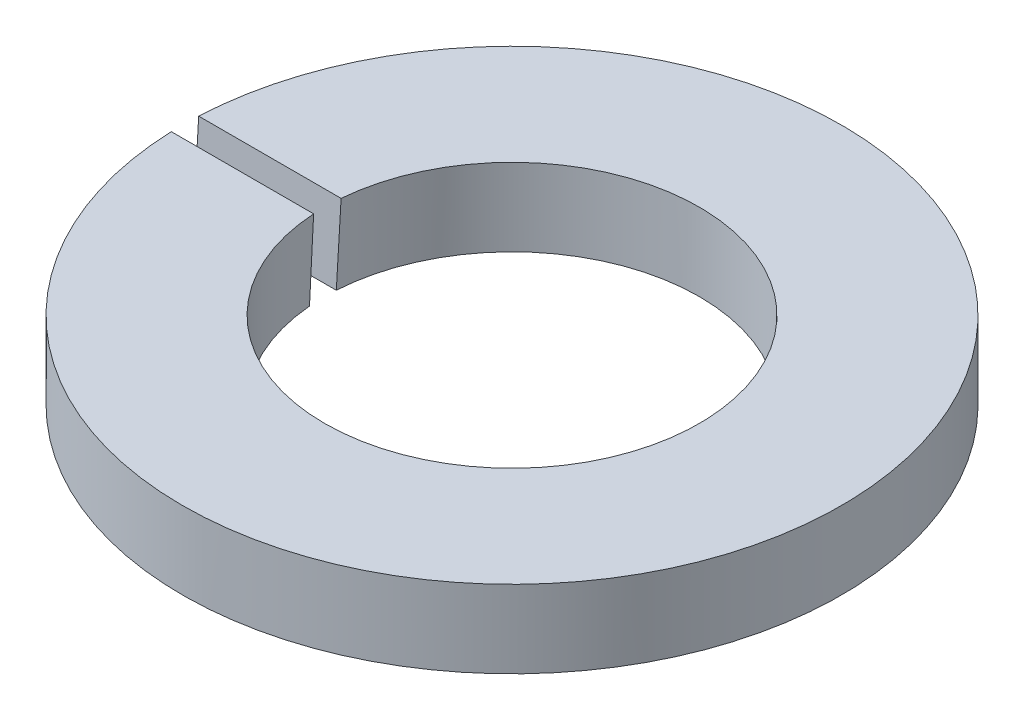
ISO-10303-21;
HEADER;
FILE_DESCRIPTION(('STEP AP214'),'2;1');
FILE_NAME('part.step','',(''),(''),'','','');
FILE_SCHEMA(('AUTOMOTIVE_DESIGN { 1 0 10303 214 1 1 1 1 }'));
ENDSEC;
DATA;
#1=APPLICATION_CONTEXT('core data for automotive mechanical design processes');
#2=APPLICATION_PROTOCOL_DEFINITION('international standard','automotive_design',2000,#1);
#3=PRODUCT_CONTEXT('',#1,'mechanical');
#4=PRODUCT('Part','Part','',(#3));
#5=PRODUCT_RELATED_PRODUCT_CATEGORY('part','',(#4));
#6=PRODUCT_DEFINITION_FORMATION('','',#4);
#7=PRODUCT_DEFINITION_CONTEXT('part definition',#1,'design');
#8=PRODUCT_DEFINITION('design','',#6,#7);
#9=PRODUCT_DEFINITION_SHAPE('','',#8);
#10=(LENGTH_UNIT() NAMED_UNIT(*) SI_UNIT(.MILLI.,.METRE.));
#11=(NAMED_UNIT(*) PLANE_ANGLE_UNIT() SI_UNIT($,.RADIAN.));
#12=(NAMED_UNIT(*) SI_UNIT($,.STERADIAN.) SOLID_ANGLE_UNIT());
#13=UNCERTAINTY_MEASURE_WITH_UNIT(LENGTH_MEASURE(1.E-05),#10,'distance_accuracy_value','');
#14=(GEOMETRIC_REPRESENTATION_CONTEXT(3) GLOBAL_UNCERTAINTY_ASSIGNED_CONTEXT((#13)) GLOBAL_UNIT_ASSIGNED_CONTEXT((#10,
#11,#12)) REPRESENTATION_CONTEXT('',''));
#15=CARTESIAN_POINT('',(0.,0.,0.));
#16=DIRECTION('',(0.,0.,1.));
#17=DIRECTION('',(1.,0.,0.));
#18=AXIS2_PLACEMENT_3D('',#15,#16,#17);
#19=CARTESIAN_POINT('',(6.00246924833974,9.4,-6.00115417619971));
#20=DIRECTION('',(0.,-1.,0.));
#21=DIRECTION('',(0.,0.,1.));
#22=AXIS2_PLACEMENT_3D('',#19,#20,#21);
#23=PLANE('',#22);
#24=DIRECTION('',(-1.,0.,0.));
#25=VECTOR('',#24,1.);
#26=CARTESIAN_POINT('',(1.40333791036605,9.4,-3.487692307692));
#27=LINE('',#26,#25);
#28=CARTESIAN_POINT('',(1.95265413284466,9.4,-3.487692307692));
#29=VERTEX_POINT('',#28);
#30=CARTESIAN_POINT('',(0.851508277594049,9.4,-3.487692307692));
#31=VERTEX_POINT('',#30);
#32=EDGE_CURVE('E75',#29,#31,#27,.T.);
#33=ORIENTED_EDGE('',*,*,#32,.T.);
#34=CARTESIAN_POINT('',(3.4,9.4,-3.4));
#35=DIRECTION('',(0.,-1.,0.));
#36=DIRECTION('',(1.,0.,0.));
#37=AXIS2_PLACEMENT_3D('',#34,#35,#36);
#38=CIRCLE('',#37,2.55);
#39=CARTESIAN_POINT('',(0.852934859803878,9.4,-3.277692307692));
#40=VERTEX_POINT('',#39);
#41=EDGE_CURVE('E66',#31,#40,#38,.T.);
#42=ORIENTED_EDGE('',*,*,#41,.T.);
#43=DIRECTION('',(1.,0.,0.));
#44=VECTOR('',#43,1.);
#45=CARTESIAN_POINT('',(1.40333791036605,9.4,-3.277692307692));
#46=LINE('',#45,#44);
#47=CARTESIAN_POINT('',(1.95516754313786,9.4,-3.277692307692));
#48=VERTEX_POINT('',#47);
#49=EDGE_CURVE('E63',#40,#48,#46,.T.);
#50=ORIENTED_EDGE('',*,*,#49,.T.);
#51=CARTESIAN_POINT('',(3.4,9.4,-3.4));
#52=DIRECTION('',(0.,-1.,0.));
#53=DIRECTION('',(1.,0.,0.));
#54=AXIS2_PLACEMENT_3D('',#51,#52,#53);
#55=CIRCLE('',#54,1.45);
#56=EDGE_CURVE('E21',#29,#48,#55,.T.);
#57=ORIENTED_EDGE('',*,*,#56,.F.);
#58=EDGE_LOOP('',(#33,#42,#50,#57));
#59=FACE_BOUND('',#58,.T.);
#60=ADVANCED_FACE('F17',(#59),#23,.T.);
#61=CARTESIAN_POINT('',(0.8515082775941,10.,-3.312307692308));
#62=DIRECTION('',(0.,0.057596535097689,0.99833994167555));
#63=DIRECTION('',(0.,-0.99833994167555,0.057596535097689));
#64=AXIS2_PLACEMENT_3D('',#61,#62,#63);
#65=PLANE('',#64);
#66=ORIENTED_EDGE('',*,*,#49,.F.);
#67=CARTESIAN_POINT('',(3.4,11.5199999999677,-3.4));
#68=DIRECTION('',(0.,0.057596535097689,0.99833994167555));
#69=DIRECTION('',(0.,-0.99833994167555,0.057596535097689));
#70=AXIS2_PLACEMENT_3D('',#67,#68,#69);
#71=ELLIPSE('',#70,44.273496585775,2.55);
#72=CARTESIAN_POINT('',(0.851508277594057,10.,-3.31230769230777));
#73=VERTEX_POINT('',#72);
#74=EDGE_CURVE('E80',#40,#73,#71,.F.);
#75=ORIENTED_EDGE('',*,*,#74,.T.);
#76=DIRECTION('',(1.,0.,0.));
#77=VECTOR('',#76,1.);
#78=CARTESIAN_POINT('',(3.42696700961166,10.,-3.31230769230753));
#79=LINE('',#78,#77);
#80=CARTESIAN_POINT('',(1.95265413284467,10.,-3.31230769230777));
#81=VERTEX_POINT('',#80);
#82=EDGE_CURVE('E74',#73,#81,#79,.T.);
#83=ORIENTED_EDGE('',*,*,#82,.T.);
#84=CARTESIAN_POINT('',(3.4,11.5199999999677,-3.4));
#85=DIRECTION('',(0.,0.057596535097689,0.99833994167555));
#86=DIRECTION('',(0.,-0.99833994167555,0.057596535097689));
#87=AXIS2_PLACEMENT_3D('',#84,#85,#86);
#88=ELLIPSE('',#87,25.1751255095583,1.45);
#89=EDGE_CURVE('E60',#48,#81,#88,.F.);
#90=ORIENTED_EDGE('',*,*,#89,.F.);
#91=EDGE_LOOP('',(#66,#75,#83,#90));
#92=FACE_BOUND('',#91,.T.);
#93=ADVANCED_FACE('F72',(#92),#65,.F.);
#94=CARTESIAN_POINT('',(3.4,10.,-3.4));
#95=DIRECTION('',(0.,-1.,0.));
#96=DIRECTION('',(1.,0.,0.));
#97=AXIS2_PLACEMENT_3D('',#94,#95,#96);
#98=CYLINDRICAL_SURFACE('',#97,1.45);
#99=CARTESIAN_POINT('',(3.4,10.,-3.4));
#100=DIRECTION('',(0.,-1.,0.));
#101=DIRECTION('',(1.,0.,0.));
#102=AXIS2_PLACEMENT_3D('',#99,#100,#101);
#103=CIRCLE('',#102,1.45);
#104=CARTESIAN_POINT('',(1.95516754313784,10.,-3.52230769230778));
#105=VERTEX_POINT('',#104);
#106=EDGE_CURVE('E82',#81,#105,#103,.F.);
#107=ORIENTED_EDGE('',*,*,#106,.T.);
#108=CARTESIAN_POINT('',(3.4,7.88000000003233,-3.4));
#109=DIRECTION('',(0.,-0.0575965350976897,-0.99833994167555));
#110=DIRECTION('',(0.,-0.99833994167555,0.0575965350976897));
#111=AXIS2_PLACEMENT_3D('',#108,#109,#110);
#112=ELLIPSE('',#111,25.175125509558,1.45);
#113=EDGE_CURVE('E62',#105,#29,#112,.F.);
#114=ORIENTED_EDGE('',*,*,#113,.T.);
#115=ORIENTED_EDGE('',*,*,#56,.T.);
#116=ORIENTED_EDGE('',*,*,#89,.T.);
#117=EDGE_LOOP('',(#107,#114,#115,#116));
#118=FACE_BOUND('',#117,.T.);
#119=ADVANCED_FACE('F58',(#118),#98,.F.);
#120=CARTESIAN_POINT('',(0.8515082775941,9.4,-3.487692307692));
#121=DIRECTION('',(0.,-0.0575965350976897,-0.99833994167555));
#122=DIRECTION('',(0.,0.99833994167555,-0.0575965350976897));
#123=AXIS2_PLACEMENT_3D('',#120,#121,#122);
#124=PLANE('',#123);
#125=ORIENTED_EDGE('',*,*,#32,.F.);
#126=ORIENTED_EDGE('',*,*,#113,.F.);
#127=DIRECTION('',(-1.,0.,0.));
#128=VECTOR('',#127,1.);
#129=CARTESIAN_POINT('',(3.42696700961166,10.,-3.52230769230756));
#130=LINE('',#129,#128);
#131=CARTESIAN_POINT('',(0.852934859803867,10.,-3.52230769230778));
#132=VERTEX_POINT('',#131);
#133=EDGE_CURVE('E27',#105,#132,#130,.T.);
#134=ORIENTED_EDGE('',*,*,#133,.T.);
#135=CARTESIAN_POINT('',(3.4,7.88000000003233,-3.4));
#136=DIRECTION('',(0.,-0.0575965350976897,-0.99833994167555));
#137=DIRECTION('',(0.,-0.99833994167555,0.0575965350976897));
#138=AXIS2_PLACEMENT_3D('',#135,#136,#137);
#139=ELLIPSE('',#138,44.2734965857744,2.55);
#140=EDGE_CURVE('E35',#132,#31,#139,.F.);
#141=ORIENTED_EDGE('',*,*,#140,.T.);
#142=EDGE_LOOP('',(#125,#126,#134,#141));
#143=FACE_BOUND('',#142,.T.);
#144=ADVANCED_FACE('F89',(#143),#124,.F.);
#145=CARTESIAN_POINT('',(3.4,10.,-3.4));
#146=DIRECTION('',(0.,-1.,0.));
#147=DIRECTION('',(1.,0.,0.));
#148=AXIS2_PLACEMENT_3D('',#145,#146,#147);
#149=CYLINDRICAL_SURFACE('',#148,2.55);
#150=ORIENTED_EDGE('',*,*,#41,.F.);
#151=ORIENTED_EDGE('',*,*,#140,.F.);
#152=CARTESIAN_POINT('',(3.4,10.,-3.4));
#153=DIRECTION('',(0.,-1.,0.));
#154=DIRECTION('',(1.,0.,0.));
#155=AXIS2_PLACEMENT_3D('',#152,#153,#154);
#156=CIRCLE('',#155,2.55);
#157=EDGE_CURVE('E11',#132,#73,#156,.T.);
#158=ORIENTED_EDGE('',*,*,#157,.T.);
#159=ORIENTED_EDGE('',*,*,#74,.F.);
#160=EDGE_LOOP('',(#150,#151,#158,#159));
#161=FACE_BOUND('',#160,.T.);
#162=ADVANCED_FACE('F91',(#161),#149,.T.);
#163=CARTESIAN_POINT('',(6.00242574162923,10.,-6.00101872279015));
#164=DIRECTION('',(0.,-1.,0.));
#165=DIRECTION('',(0.,0.,1.));
#166=AXIS2_PLACEMENT_3D('',#163,#164,#165);
#167=PLANE('',#166);
#168=ORIENTED_EDGE('',*,*,#133,.F.);
#169=ORIENTED_EDGE('',*,*,#106,.F.);
#170=ORIENTED_EDGE('',*,*,#82,.F.);
#171=ORIENTED_EDGE('',*,*,#157,.F.);
#172=EDGE_LOOP('',(#168,#169,#170,#171));
#173=FACE_BOUND('',#172,.T.);
#174=ADVANCED_FACE('F19',(#173),#167,.F.);
#175=CLOSED_SHELL('',(#60,#93,#119,#144,#162,#174));
#176=MANIFOLD_SOLID_BREP('B1',#175);
#177=ADVANCED_BREP_SHAPE_REPRESENTATION('',(#18,#176),#14);
#178=SHAPE_DEFINITION_REPRESENTATION(#9,#177);
ENDSEC;
END-ISO-10303-21;
